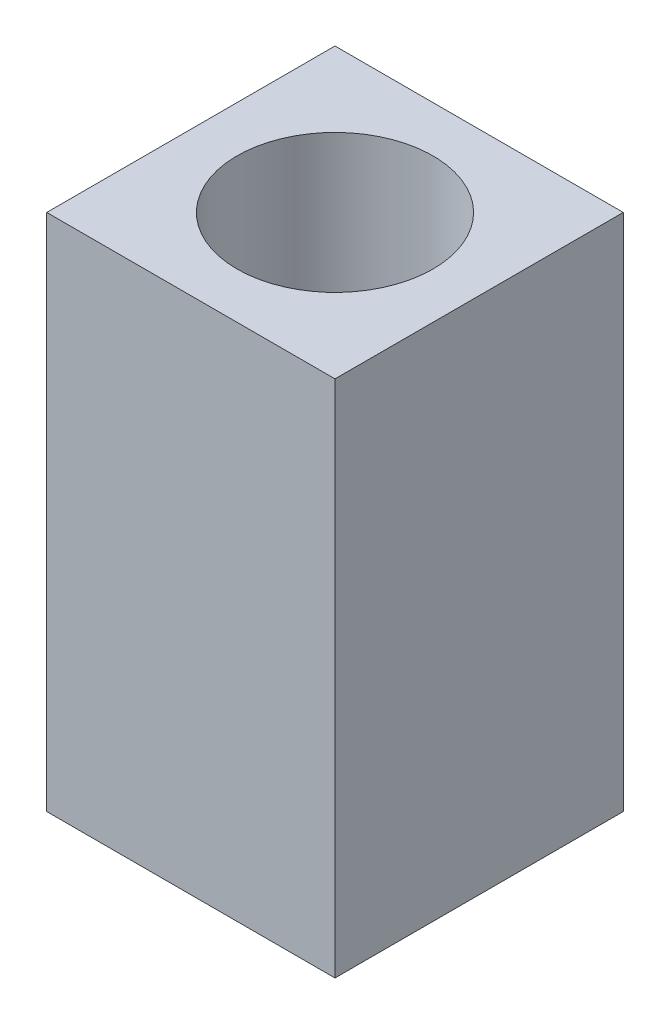
ISO-10303-21;
HEADER;
FILE_DESCRIPTION(('STEP AP214'),'2;1');
FILE_NAME('part.step','',(''),(''),'','','');
FILE_SCHEMA(('AUTOMOTIVE_DESIGN { 1 0 10303 214 1 1 1 1 }'));
ENDSEC;
DATA;
#1=APPLICATION_CONTEXT('core data for automotive mechanical design processes');
#2=APPLICATION_PROTOCOL_DEFINITION('international standard','automotive_design',2000,#1);
#3=PRODUCT_CONTEXT('',#1,'mechanical');
#4=PRODUCT('Part','Part','',(#3));
#5=PRODUCT_RELATED_PRODUCT_CATEGORY('part','',(#4));
#6=PRODUCT_DEFINITION_FORMATION('','',#4);
#7=PRODUCT_DEFINITION_CONTEXT('part definition',#1,'design');
#8=PRODUCT_DEFINITION('design','',#6,#7);
#9=PRODUCT_DEFINITION_SHAPE('','',#8);
#10=(LENGTH_UNIT() NAMED_UNIT(*) SI_UNIT(.MILLI.,.METRE.));
#11=(NAMED_UNIT(*) PLANE_ANGLE_UNIT() SI_UNIT($,.RADIAN.));
#12=(NAMED_UNIT(*) SI_UNIT($,.STERADIAN.) SOLID_ANGLE_UNIT());
#13=UNCERTAINTY_MEASURE_WITH_UNIT(LENGTH_MEASURE(1.E-05),#10,'distance_accuracy_value','');
#14=(GEOMETRIC_REPRESENTATION_CONTEXT(3) GLOBAL_UNCERTAINTY_ASSIGNED_CONTEXT((#13)) GLOBAL_UNIT_ASSIGNED_CONTEXT((#10,
#11,#12)) REPRESENTATION_CONTEXT('',''));
#15=CARTESIAN_POINT('',(0.,0.,0.));
#16=DIRECTION('',(0.,0.,1.));
#17=DIRECTION('',(1.,0.,0.));
#18=AXIS2_PLACEMENT_3D('',#15,#16,#17);
#19=CARTESIAN_POINT('',(0.,9.,0.));
#20=DIRECTION('',(0.,-1.,0.));
#21=DIRECTION('',(0.,0.,-1.));
#22=AXIS2_PLACEMENT_3D('',#19,#20,#21);
#23=PLANE('',#22);
#24=DIRECTION('',(0.,0.,-1.));
#25=VECTOR('',#24,1.);
#26=CARTESIAN_POINT('',(2.5,9.,2.5));
#27=LINE('',#26,#25);
#28=CARTESIAN_POINT('',(2.5,9.,2.5));
#29=VERTEX_POINT('',#28);
#30=CARTESIAN_POINT('',(2.5,9.,-2.5));
#31=VERTEX_POINT('',#30);
#32=EDGE_CURVE('E92',#29,#31,#27,.T.);
#33=ORIENTED_EDGE('',*,*,#32,.T.);
#34=DIRECTION('',(-1.,0.,0.));
#35=VECTOR('',#34,1.);
#36=CARTESIAN_POINT('',(-2.5,9.,-2.5));
#37=LINE('',#36,#35);
#38=CARTESIAN_POINT('',(-2.5,9.,-2.5));
#39=VERTEX_POINT('',#38);
#40=EDGE_CURVE('E87',#31,#39,#37,.T.);
#41=ORIENTED_EDGE('',*,*,#40,.T.);
#42=DIRECTION('',(0.,0.,1.));
#43=VECTOR('',#42,1.);
#44=CARTESIAN_POINT('',(-2.5,9.,2.5));
#45=LINE('',#44,#43);
#46=CARTESIAN_POINT('',(-2.5,9.,2.5));
#47=VERTEX_POINT('',#46);
#48=EDGE_CURVE('E90',#39,#47,#45,.T.);
#49=ORIENTED_EDGE('',*,*,#48,.T.);
#50=DIRECTION('',(1.,0.,0.));
#51=VECTOR('',#50,1.);
#52=CARTESIAN_POINT('',(-2.5,9.,2.5));
#53=LINE('',#52,#51);
#54=EDGE_CURVE('E57',#47,#29,#53,.T.);
#55=ORIENTED_EDGE('',*,*,#54,.T.);
#56=EDGE_LOOP('',(#33,#41,#49,#55));
#57=FACE_BOUND('',#56,.T.);
#58=CARTESIAN_POINT('',(0.,9.,0.));
#59=DIRECTION('',(0.,1.,0.));
#60=DIRECTION('',(0.,0.,1.));
#61=AXIS2_PLACEMENT_3D('',#58,#59,#60);
#62=CIRCLE('',#61,1.7);
#63=CARTESIAN_POINT('',(0.,9.,1.7));
#64=VERTEX_POINT('',#63);
#65=EDGE_CURVE('E112',#64,#64,#62,.T.);
#66=ORIENTED_EDGE('',*,*,#65,.F.);
#67=EDGE_LOOP('',(#66));
#68=FACE_BOUND('',#67,.T.);
#69=ADVANCED_FACE('F39',(#57,#68),#23,.F.);
#70=CARTESIAN_POINT('',(0.,0.,0.));
#71=DIRECTION('',(0.,-1.,0.));
#72=DIRECTION('',(0.,0.,-1.));
#73=AXIS2_PLACEMENT_3D('',#70,#71,#72);
#74=PLANE('',#73);
#75=DIRECTION('',(0.,0.,-1.));
#76=VECTOR('',#75,1.);
#77=CARTESIAN_POINT('',(2.5,0.,2.5));
#78=LINE('',#77,#76);
#79=CARTESIAN_POINT('',(2.5,0.,2.5));
#80=VERTEX_POINT('',#79);
#81=CARTESIAN_POINT('',(2.5,0.,-2.5));
#82=VERTEX_POINT('',#81);
#83=EDGE_CURVE('E108',#80,#82,#78,.T.);
#84=ORIENTED_EDGE('',*,*,#83,.F.);
#85=DIRECTION('',(1.,0.,0.));
#86=VECTOR('',#85,1.);
#87=CARTESIAN_POINT('',(-2.5,0.,2.5));
#88=LINE('',#87,#86);
#89=CARTESIAN_POINT('',(-2.5,0.,2.5));
#90=VERTEX_POINT('',#89);
#91=EDGE_CURVE('E80',#90,#80,#88,.T.);
#92=ORIENTED_EDGE('',*,*,#91,.F.);
#93=DIRECTION('',(0.,0.,1.));
#94=VECTOR('',#93,1.);
#95=CARTESIAN_POINT('',(-2.5,0.,2.5));
#96=LINE('',#95,#94);
#97=CARTESIAN_POINT('',(-2.5,0.,-2.5));
#98=VERTEX_POINT('',#97);
#99=EDGE_CURVE('E74',#98,#90,#96,.T.);
#100=ORIENTED_EDGE('',*,*,#99,.F.);
#101=DIRECTION('',(-1.,0.,0.));
#102=VECTOR('',#101,1.);
#103=CARTESIAN_POINT('',(-2.5,0.,-2.5));
#104=LINE('',#103,#102);
#105=EDGE_CURVE('E97',#82,#98,#104,.T.);
#106=ORIENTED_EDGE('',*,*,#105,.F.);
#107=EDGE_LOOP('',(#84,#92,#100,#106));
#108=FACE_BOUND('',#107,.T.);
#109=CARTESIAN_POINT('',(0.,0.,0.));
#110=DIRECTION('',(0.,1.,0.));
#111=DIRECTION('',(0.,0.,1.));
#112=AXIS2_PLACEMENT_3D('',#109,#110,#111);
#113=CIRCLE('',#112,1.7);
#114=CARTESIAN_POINT('',(0.,0.,1.7));
#115=VERTEX_POINT('',#114);
#116=EDGE_CURVE('E130',#115,#115,#113,.T.);
#117=ORIENTED_EDGE('',*,*,#116,.T.);
#118=EDGE_LOOP('',(#117));
#119=FACE_BOUND('',#118,.T.);
#120=ADVANCED_FACE('F125',(#108,#119),#74,.T.);
#121=CARTESIAN_POINT('',(2.5,9.,2.5));
#122=DIRECTION('',(-1.,0.,0.));
#123=DIRECTION('',(0.,0.,1.));
#124=AXIS2_PLACEMENT_3D('',#121,#122,#123);
#125=PLANE('',#124);
#126=ORIENTED_EDGE('',*,*,#83,.T.);
#127=DIRECTION('',(0.,-1.,0.));
#128=VECTOR('',#127,1.);
#129=CARTESIAN_POINT('',(2.5,9.,-2.5));
#130=LINE('',#129,#128);
#131=EDGE_CURVE('E11',#31,#82,#130,.T.);
#132=ORIENTED_EDGE('',*,*,#131,.F.);
#133=ORIENTED_EDGE('',*,*,#32,.F.);
#134=DIRECTION('',(0.,-1.,0.));
#135=VECTOR('',#134,1.);
#136=CARTESIAN_POINT('',(2.5,9.,2.5));
#137=LINE('',#136,#135);
#138=EDGE_CURVE('E104',#29,#80,#137,.T.);
#139=ORIENTED_EDGE('',*,*,#138,.T.);
#140=EDGE_LOOP('',(#126,#132,#133,#139));
#141=FACE_BOUND('',#140,.T.);
#142=ADVANCED_FACE('F41',(#141),#125,.F.);
#143=CARTESIAN_POINT('',(-2.5,9.,-2.5));
#144=DIRECTION('',(0.,0.,1.));
#145=DIRECTION('',(1.,0.,0.));
#146=AXIS2_PLACEMENT_3D('',#143,#144,#145);
#147=PLANE('',#146);
#148=ORIENTED_EDGE('',*,*,#105,.T.);
#149=DIRECTION('',(0.,-1.,0.));
#150=VECTOR('',#149,1.);
#151=CARTESIAN_POINT('',(-2.5,9.,-2.5));
#152=LINE('',#151,#150);
#153=EDGE_CURVE('E49',#39,#98,#152,.T.);
#154=ORIENTED_EDGE('',*,*,#153,.F.);
#155=ORIENTED_EDGE('',*,*,#40,.F.);
#156=ORIENTED_EDGE('',*,*,#131,.T.);
#157=EDGE_LOOP('',(#148,#154,#155,#156));
#158=FACE_BOUND('',#157,.T.);
#159=ADVANCED_FACE('F96',(#158),#147,.F.);
#160=CARTESIAN_POINT('',(-2.5,9.,2.5));
#161=DIRECTION('',(1.,0.,0.));
#162=DIRECTION('',(0.,0.,-1.));
#163=AXIS2_PLACEMENT_3D('',#160,#161,#162);
#164=PLANE('',#163);
#165=ORIENTED_EDGE('',*,*,#99,.T.);
#166=DIRECTION('',(0.,-1.,0.));
#167=VECTOR('',#166,1.);
#168=CARTESIAN_POINT('',(-2.5,9.,2.5));
#169=LINE('',#168,#167);
#170=EDGE_CURVE('E99',#47,#90,#169,.T.);
#171=ORIENTED_EDGE('',*,*,#170,.F.);
#172=ORIENTED_EDGE('',*,*,#48,.F.);
#173=ORIENTED_EDGE('',*,*,#153,.T.);
#174=EDGE_LOOP('',(#165,#171,#172,#173));
#175=FACE_BOUND('',#174,.T.);
#176=ADVANCED_FACE('F100',(#175),#164,.F.);
#177=CARTESIAN_POINT('',(-2.5,9.,2.5));
#178=DIRECTION('',(0.,0.,-1.));
#179=DIRECTION('',(-1.,0.,0.));
#180=AXIS2_PLACEMENT_3D('',#177,#178,#179);
#181=PLANE('',#180);
#182=ORIENTED_EDGE('',*,*,#91,.T.);
#183=ORIENTED_EDGE('',*,*,#138,.F.);
#184=ORIENTED_EDGE('',*,*,#54,.F.);
#185=ORIENTED_EDGE('',*,*,#170,.T.);
#186=EDGE_LOOP('',(#182,#183,#184,#185));
#187=FACE_BOUND('',#186,.T.);
#188=ADVANCED_FACE('F122',(#187),#181,.F.);
#189=CARTESIAN_POINT('',(0.,9.,0.));
#190=DIRECTION('',(0.,-1.,0.));
#191=DIRECTION('',(0.,0.,-1.));
#192=AXIS2_PLACEMENT_3D('',#189,#190,#191);
#193=CYLINDRICAL_SURFACE('',#192,1.7);
#194=ORIENTED_EDGE('',*,*,#65,.T.);
#195=EDGE_LOOP('',(#194));
#196=FACE_BOUND('',#195,.T.);
#197=ORIENTED_EDGE('',*,*,#116,.F.);
#198=EDGE_LOOP('',(#197));
#199=FACE_BOUND('',#198,.T.);
#200=ADVANCED_FACE('F138',(#196,#199),#193,.F.);
#201=CLOSED_SHELL('',(#69,#120,#142,#159,#176,#188,#200));
#202=MANIFOLD_SOLID_BREP('B2',#201);
#203=ADVANCED_BREP_SHAPE_REPRESENTATION('',(#18,#202),#14);
#204=SHAPE_DEFINITION_REPRESENTATION(#9,#203);
ENDSEC;
END-ISO-10303-21;
